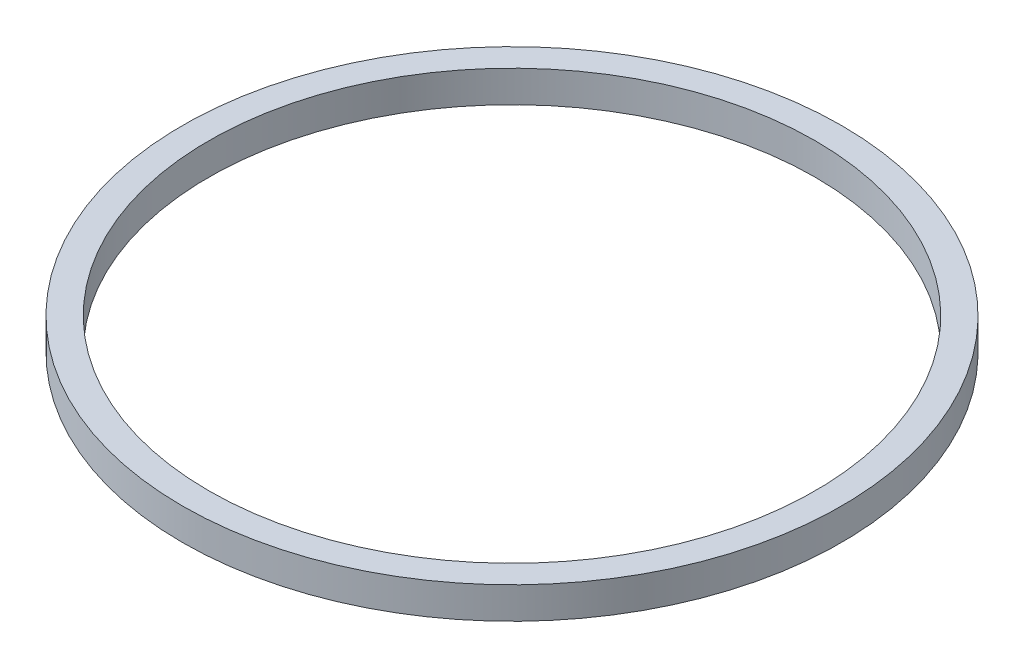
ISO-10303-21;
HEADER;
FILE_DESCRIPTION(('STEP AP214'),'2;1');
FILE_NAME('part.step','',(''),(''),'','','');
FILE_SCHEMA(('AUTOMOTIVE_DESIGN { 1 0 10303 214 1 1 1 1 }'));
ENDSEC;
DATA;
#1=APPLICATION_CONTEXT('core data for automotive mechanical design processes');
#2=APPLICATION_PROTOCOL_DEFINITION('international standard','automotive_design',2000,#1);
#3=PRODUCT_CONTEXT('',#1,'mechanical');
#4=PRODUCT('Part','Part','',(#3));
#5=PRODUCT_RELATED_PRODUCT_CATEGORY('part','',(#4));
#6=PRODUCT_DEFINITION_FORMATION('','',#4);
#7=PRODUCT_DEFINITION_CONTEXT('part definition',#1,'design');
#8=PRODUCT_DEFINITION('design','',#6,#7);
#9=PRODUCT_DEFINITION_SHAPE('','',#8);
#10=(LENGTH_UNIT() NAMED_UNIT(*) SI_UNIT(.MILLI.,.METRE.));
#11=(NAMED_UNIT(*) PLANE_ANGLE_UNIT() SI_UNIT($,.RADIAN.));
#12=(NAMED_UNIT(*) SI_UNIT($,.STERADIAN.) SOLID_ANGLE_UNIT());
#13=UNCERTAINTY_MEASURE_WITH_UNIT(LENGTH_MEASURE(1.E-05),#10,'distance_accuracy_value','');
#14=(GEOMETRIC_REPRESENTATION_CONTEXT(3) GLOBAL_UNCERTAINTY_ASSIGNED_CONTEXT((#13)) GLOBAL_UNIT_ASSIGNED_CONTEXT((#10,
#11,#12)) REPRESENTATION_CONTEXT('',''));
#15=CARTESIAN_POINT('',(0.,0.,0.));
#16=DIRECTION('',(0.,0.,1.));
#17=DIRECTION('',(1.,0.,0.));
#18=AXIS2_PLACEMENT_3D('',#15,#16,#17);
#19=CARTESIAN_POINT('',(0.,6.,0.));
#20=DIRECTION('',(0.,1.,0.));
#21=DIRECTION('',(0.,0.,1.));
#22=AXIS2_PLACEMENT_3D('',#19,#20,#21);
#23=PLANE('',#22);
#24=CARTESIAN_POINT('',(0.,6.,0.));
#25=DIRECTION('',(0.,1.,0.));
#26=DIRECTION('',(0.,0.,1.));
#27=AXIS2_PLACEMENT_3D('',#24,#25,#26);
#28=CIRCLE('',#27,62.5);
#29=CARTESIAN_POINT('',(0.,6.,62.5));
#30=VERTEX_POINT('',#29);
#31=EDGE_CURVE('E10',#30,#30,#28,.T.);
#32=ORIENTED_EDGE('',*,*,#31,.T.);
#33=EDGE_LOOP('',(#32));
#34=FACE_BOUND('',#33,.T.);
#35=CARTESIAN_POINT('',(0.,6.,0.));
#36=DIRECTION('',(0.,1.,0.));
#37=DIRECTION('',(0.,0.,1.));
#38=AXIS2_PLACEMENT_3D('',#35,#36,#37);
#39=CIRCLE('',#38,57.5);
#40=CARTESIAN_POINT('',(0.,6.,57.5));
#41=VERTEX_POINT('',#40);
#42=EDGE_CURVE('E54',#41,#41,#39,.T.);
#43=ORIENTED_EDGE('',*,*,#42,.F.);
#44=EDGE_LOOP('',(#43));
#45=FACE_BOUND('',#44,.T.);
#46=ADVANCED_FACE('F43',(#34,#45),#23,.T.);
#47=CARTESIAN_POINT('',(0.,0.,0.));
#48=DIRECTION('',(0.,1.,0.));
#49=DIRECTION('',(0.,0.,1.));
#50=AXIS2_PLACEMENT_3D('',#47,#48,#49);
#51=PLANE('',#50);
#52=CARTESIAN_POINT('',(0.,0.,0.));
#53=DIRECTION('',(0.,1.,0.));
#54=DIRECTION('',(0.,0.,1.));
#55=AXIS2_PLACEMENT_3D('',#52,#53,#54);
#56=CIRCLE('',#55,62.5);
#57=CARTESIAN_POINT('',(0.,0.,62.5));
#58=VERTEX_POINT('',#57);
#59=EDGE_CURVE('E47',#58,#58,#56,.T.);
#60=ORIENTED_EDGE('',*,*,#59,.F.);
#61=EDGE_LOOP('',(#60));
#62=FACE_BOUND('',#61,.T.);
#63=CARTESIAN_POINT('',(0.,0.,0.));
#64=DIRECTION('',(0.,1.,0.));
#65=DIRECTION('',(0.,0.,1.));
#66=AXIS2_PLACEMENT_3D('',#63,#64,#65);
#67=CIRCLE('',#66,57.5);
#68=CARTESIAN_POINT('',(0.,0.,57.5));
#69=VERTEX_POINT('',#68);
#70=EDGE_CURVE('E56',#69,#69,#67,.T.);
#71=ORIENTED_EDGE('',*,*,#70,.T.);
#72=EDGE_LOOP('',(#71));
#73=FACE_BOUND('',#72,.T.);
#74=ADVANCED_FACE('F66',(#62,#73),#51,.F.);
#75=CARTESIAN_POINT('',(0.,6.,0.));
#76=DIRECTION('',(0.,-1.,0.));
#77=DIRECTION('',(0.,0.,-1.));
#78=AXIS2_PLACEMENT_3D('',#75,#76,#77);
#79=CYLINDRICAL_SURFACE('',#78,62.5);
#80=ORIENTED_EDGE('',*,*,#31,.F.);
#81=EDGE_LOOP('',(#80));
#82=FACE_BOUND('',#81,.T.);
#83=ORIENTED_EDGE('',*,*,#59,.T.);
#84=EDGE_LOOP('',(#83));
#85=FACE_BOUND('',#84,.T.);
#86=ADVANCED_FACE('F45',(#82,#85),#79,.T.);
#87=CARTESIAN_POINT('',(0.,6.,0.));
#88=DIRECTION('',(0.,-1.,0.));
#89=DIRECTION('',(0.,0.,-1.));
#90=AXIS2_PLACEMENT_3D('',#87,#88,#89);
#91=CYLINDRICAL_SURFACE('',#90,57.5);
#92=ORIENTED_EDGE('',*,*,#42,.T.);
#93=EDGE_LOOP('',(#92));
#94=FACE_BOUND('',#93,.T.);
#95=ORIENTED_EDGE('',*,*,#70,.F.);
#96=EDGE_LOOP('',(#95));
#97=FACE_BOUND('',#96,.T.);
#98=ADVANCED_FACE('F62',(#94,#97),#91,.F.);
#99=CLOSED_SHELL('',(#46,#74,#86,#98));
#100=MANIFOLD_SOLID_BREP('B2',#99);
#101=ADVANCED_BREP_SHAPE_REPRESENTATION('',(#18,#100),#14);
#102=SHAPE_DEFINITION_REPRESENTATION(#9,#101);
ENDSEC;
END-ISO-10303-21;
